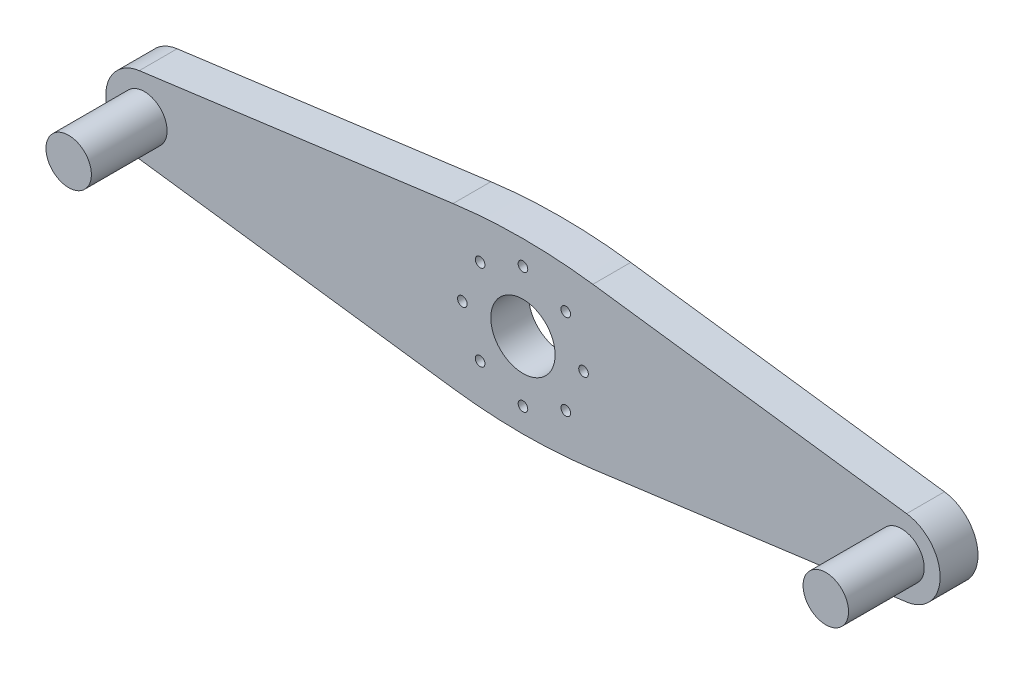
ISO-10303-21;
HEADER;
FILE_DESCRIPTION(('STEP AP214'),'2;1');
FILE_NAME('part.step','',(''),(''),'','','');
FILE_SCHEMA(('AUTOMOTIVE_DESIGN { 1 0 10303 214 1 1 1 1 }'));
ENDSEC;
DATA;
#1=APPLICATION_CONTEXT('core data for automotive mechanical design processes');
#2=APPLICATION_PROTOCOL_DEFINITION('international standard','automotive_design',2000,#1);
#3=PRODUCT_CONTEXT('',#1,'mechanical');
#4=PRODUCT('Part','Part','',(#3));
#5=PRODUCT_RELATED_PRODUCT_CATEGORY('part','',(#4));
#6=PRODUCT_DEFINITION_FORMATION('','',#4);
#7=PRODUCT_DEFINITION_CONTEXT('part definition',#1,'design');
#8=PRODUCT_DEFINITION('design','',#6,#7);
#9=PRODUCT_DEFINITION_SHAPE('','',#8);
#10=(LENGTH_UNIT() NAMED_UNIT(*) SI_UNIT(.MILLI.,.METRE.));
#11=(NAMED_UNIT(*) PLANE_ANGLE_UNIT() SI_UNIT($,.RADIAN.));
#12=(NAMED_UNIT(*) SI_UNIT($,.STERADIAN.) SOLID_ANGLE_UNIT());
#13=UNCERTAINTY_MEASURE_WITH_UNIT(LENGTH_MEASURE(1.E-05),#10,'distance_accuracy_value','');
#14=(GEOMETRIC_REPRESENTATION_CONTEXT(3) GLOBAL_UNCERTAINTY_ASSIGNED_CONTEXT((#13)) GLOBAL_UNIT_ASSIGNED_CONTEXT((#10,
#11,#12)) REPRESENTATION_CONTEXT('',''));
#15=CARTESIAN_POINT('',(0.,0.,0.));
#16=DIRECTION('',(0.,0.,1.));
#17=DIRECTION('',(1.,0.,0.));
#18=AXIS2_PLACEMENT_3D('',#15,#16,#17);
#19=CARTESIAN_POINT('',(50.,0.,5.));
#20=DIRECTION('',(0.,0.,-1.));
#21=DIRECTION('',(-1.,0.,0.));
#22=AXIS2_PLACEMENT_3D('',#19,#20,#21);
#23=PLANE('',#22);
#24=CARTESIAN_POINT('',(50.,0.,5.));
#25=DIRECTION('',(0.,0.,1.));
#26=DIRECTION('',(-1.,0.,0.));
#27=AXIS2_PLACEMENT_3D('',#24,#25,#26);
#28=CIRCLE('',#27,5.10024633771241);
#29=CARTESIAN_POINT('',(50.6728763500851,-5.05566515137672,5.));
#30=VERTEX_POINT('',#29);
#31=CARTESIAN_POINT('',(50.6728763500851,5.05566515137672,5.));
#32=VERTEX_POINT('',#31);
#33=EDGE_CURVE('E148',#30,#32,#28,.T.);
#34=ORIENTED_EDGE('',*,*,#33,.T.);
#35=DIRECTION('',(-0.991259013117456,0.131930166805804,0.));
#36=VECTOR('',#35,1.);
#37=CARTESIAN_POINT('',(50.6728763500851,5.05566515137672,5.));
#38=LINE('',#37,#36);
#39=CARTESIAN_POINT('',(9.2351116764065,10.5707637614413,5.));
#40=VERTEX_POINT('',#39);
#41=EDGE_CURVE('E96',#32,#40,#38,.T.);
#42=ORIENTED_EDGE('',*,*,#41,.T.);
#43=CARTESIAN_POINT('',(0.,-58.8173671567806,5.));
#44=DIRECTION('',(0.,0.,1.));
#45=DIRECTION('',(-1.,0.,0.));
#46=AXIS2_PLACEMENT_3D('',#43,#44,#45);
#47=CIRCLE('',#46,70.);
#48=CARTESIAN_POINT('',(-9.23511167640649,10.5707637614413,5.));
#49=VERTEX_POINT('',#48);
#50=EDGE_CURVE('E163',#40,#49,#47,.T.);
#51=ORIENTED_EDGE('',*,*,#50,.T.);
#52=DIRECTION('',(-0.991259013117456,-0.131930166805804,0.));
#53=VECTOR('',#52,1.);
#54=CARTESIAN_POINT('',(-50.6728763500851,5.05566515137672,5.));
#55=LINE('',#54,#53);
#56=CARTESIAN_POINT('',(-50.6728763500851,5.05566515137672,5.));
#57=VERTEX_POINT('',#56);
#58=EDGE_CURVE('E176',#49,#57,#55,.T.);
#59=ORIENTED_EDGE('',*,*,#58,.T.);
#60=CARTESIAN_POINT('',(-50.,0.,5.));
#61=DIRECTION('',(0.,0.,1.));
#62=DIRECTION('',(1.,0.,0.));
#63=AXIS2_PLACEMENT_3D('',#60,#61,#62);
#64=CIRCLE('',#63,5.10024633771241);
#65=CARTESIAN_POINT('',(-50.6728763500851,-5.05566515137672,5.));
#66=VERTEX_POINT('',#65);
#67=EDGE_CURVE('E115',#57,#66,#64,.T.);
#68=ORIENTED_EDGE('',*,*,#67,.T.);
#69=DIRECTION('',(0.991259013117456,-0.131930166805804,0.));
#70=VECTOR('',#69,1.);
#71=CARTESIAN_POINT('',(-50.6728763500851,-5.05566515137672,5.));
#72=LINE('',#71,#70);
#73=CARTESIAN_POINT('',(-9.23511167640653,-10.5707637614413,5.));
#74=VERTEX_POINT('',#73);
#75=EDGE_CURVE('E109',#66,#74,#72,.T.);
#76=ORIENTED_EDGE('',*,*,#75,.T.);
#77=CARTESIAN_POINT('',(0.,58.8173671567806,5.));
#78=DIRECTION('',(0.,0.,1.));
#79=DIRECTION('',(1.,0.,0.));
#80=AXIS2_PLACEMENT_3D('',#77,#78,#79);
#81=CIRCLE('',#80,70.);
#82=CARTESIAN_POINT('',(9.23511167640649,-10.5707637614413,5.));
#83=VERTEX_POINT('',#82);
#84=EDGE_CURVE('E113',#74,#83,#81,.T.);
#85=ORIENTED_EDGE('',*,*,#84,.T.);
#86=DIRECTION('',(0.991259013117456,0.131930166805804,0.));
#87=VECTOR('',#86,1.);
#88=CARTESIAN_POINT('',(50.6728763500851,-5.05566515137672,5.));
#89=LINE('',#88,#87);
#90=EDGE_CURVE('E53',#83,#30,#89,.T.);
#91=ORIENTED_EDGE('',*,*,#90,.T.);
#92=EDGE_LOOP('',(#34,#42,#51,#59,#68,#76,#85,#91));
#93=FACE_BOUND('',#92,.T.);
#94=CARTESIAN_POINT('',(0.,0.,5.));
#95=DIRECTION('',(0.,0.,1.));
#96=DIRECTION('',(1.,0.,0.));
#97=AXIS2_PLACEMENT_3D('',#94,#95,#96);
#98=CIRCLE('',#97,4.25);
#99=CARTESIAN_POINT('',(4.25,0.,5.));
#100=VERTEX_POINT('',#99);
#101=EDGE_CURVE('E137',#100,#100,#98,.T.);
#102=ORIENTED_EDGE('',*,*,#101,.F.);
#103=EDGE_LOOP('',(#102));
#104=FACE_BOUND('',#103,.T.);
#105=CARTESIAN_POINT('',(-8.,0.,5.));
#106=DIRECTION('',(0.,0.,1.));
#107=DIRECTION('',(1.,0.,0.));
#108=AXIS2_PLACEMENT_3D('',#105,#106,#107);
#109=CIRCLE('',#108,0.635000000000001);
#110=CARTESIAN_POINT('',(-7.365,0.,5.));
#111=VERTEX_POINT('',#110);
#112=EDGE_CURVE('E185',#111,#111,#109,.T.);
#113=ORIENTED_EDGE('',*,*,#112,.F.);
#114=EDGE_LOOP('',(#113));
#115=FACE_BOUND('',#114,.T.);
#116=CARTESIAN_POINT('',(-50.,0.,5.));
#117=DIRECTION('',(0.,0.,1.));
#118=DIRECTION('',(1.,0.,0.));
#119=AXIS2_PLACEMENT_3D('',#116,#117,#118);
#120=CIRCLE('',#119,3.);
#121=CARTESIAN_POINT('',(-47.,0.,5.));
#122=VERTEX_POINT('',#121);
#123=EDGE_CURVE('E191',#122,#122,#120,.T.);
#124=ORIENTED_EDGE('',*,*,#123,.F.);
#125=EDGE_LOOP('',(#124));
#126=FACE_BOUND('',#125,.T.);
#127=CARTESIAN_POINT('',(-5.65685424949237,5.65685424949239,5.));
#128=DIRECTION('',(0.,0.,1.));
#129=DIRECTION('',(1.,0.,0.));
#130=AXIS2_PLACEMENT_3D('',#127,#128,#129);
#131=CIRCLE('',#130,0.635000000000001);
#132=CARTESIAN_POINT('',(-5.02185424949237,5.65685424949239,5.));
#133=VERTEX_POINT('',#132);
#134=EDGE_CURVE('E196',#133,#133,#131,.T.);
#135=ORIENTED_EDGE('',*,*,#134,.F.);
#136=EDGE_LOOP('',(#135));
#137=FACE_BOUND('',#136,.T.);
#138=CARTESIAN_POINT('',(0.,8.,5.));
#139=DIRECTION('',(0.,0.,1.));
#140=DIRECTION('',(1.,0.,0.));
#141=AXIS2_PLACEMENT_3D('',#138,#139,#140);
#142=CIRCLE('',#141,0.635000000000001);
#143=CARTESIAN_POINT('',(0.63500000000003,8.,5.));
#144=VERTEX_POINT('',#143);
#145=EDGE_CURVE('E200',#144,#144,#142,.T.);
#146=ORIENTED_EDGE('',*,*,#145,.F.);
#147=EDGE_LOOP('',(#146));
#148=FACE_BOUND('',#147,.T.);
#149=CARTESIAN_POINT('',(50.,0.,5.));
#150=DIRECTION('',(0.,0.,1.));
#151=DIRECTION('',(-1.,0.,0.));
#152=AXIS2_PLACEMENT_3D('',#149,#150,#151);
#153=CIRCLE('',#152,3.);
#154=CARTESIAN_POINT('',(47.,0.,5.));
#155=VERTEX_POINT('',#154);
#156=EDGE_CURVE('E206',#155,#155,#153,.T.);
#157=ORIENTED_EDGE('',*,*,#156,.F.);
#158=EDGE_LOOP('',(#157));
#159=FACE_BOUND('',#158,.T.);
#160=CARTESIAN_POINT('',(5.65685424949241,5.65685424949235,5.));
#161=DIRECTION('',(0.,0.,1.));
#162=DIRECTION('',(1.,0.,0.));
#163=AXIS2_PLACEMENT_3D('',#160,#161,#162);
#164=CIRCLE('',#163,0.635);
#165=CARTESIAN_POINT('',(6.29185424949241,5.65685424949235,5.));
#166=VERTEX_POINT('',#165);
#167=EDGE_CURVE('E211',#166,#166,#164,.T.);
#168=ORIENTED_EDGE('',*,*,#167,.F.);
#169=EDGE_LOOP('',(#168));
#170=FACE_BOUND('',#169,.T.);
#171=CARTESIAN_POINT('',(8.,0.,5.));
#172=DIRECTION('',(0.,0.,1.));
#173=DIRECTION('',(1.,0.,0.));
#174=AXIS2_PLACEMENT_3D('',#171,#172,#173);
#175=CIRCLE('',#174,0.635);
#176=CARTESIAN_POINT('',(8.635,0.,5.));
#177=VERTEX_POINT('',#176);
#178=EDGE_CURVE('E215',#177,#177,#175,.T.);
#179=ORIENTED_EDGE('',*,*,#178,.F.);
#180=EDGE_LOOP('',(#179));
#181=FACE_BOUND('',#180,.T.);
#182=CARTESIAN_POINT('',(5.65685424949233,-5.65685424949243,5.));
#183=DIRECTION('',(0.,0.,1.));
#184=DIRECTION('',(1.,0.,0.));
#185=AXIS2_PLACEMENT_3D('',#182,#183,#184);
#186=CIRCLE('',#185,0.635000000000001);
#187=CARTESIAN_POINT('',(6.29185424949233,-5.65685424949243,5.));
#188=VERTEX_POINT('',#187);
#189=EDGE_CURVE('E221',#188,#188,#186,.T.);
#190=ORIENTED_EDGE('',*,*,#189,.F.);
#191=EDGE_LOOP('',(#190));
#192=FACE_BOUND('',#191,.T.);
#193=CARTESIAN_POINT('',(0.,-8.,5.));
#194=DIRECTION('',(0.,0.,1.));
#195=DIRECTION('',(1.,0.,0.));
#196=AXIS2_PLACEMENT_3D('',#193,#194,#195);
#197=CIRCLE('',#196,0.635);
#198=CARTESIAN_POINT('',(0.634999999999915,-8.,5.));
#199=VERTEX_POINT('',#198);
#200=EDGE_CURVE('E227',#199,#199,#197,.T.);
#201=ORIENTED_EDGE('',*,*,#200,.F.);
#202=EDGE_LOOP('',(#201));
#203=FACE_BOUND('',#202,.T.);
#204=CARTESIAN_POINT('',(-5.65685424949245,-5.65685424949231,5.));
#205=DIRECTION('',(0.,0.,1.));
#206=DIRECTION('',(1.,0.,0.));
#207=AXIS2_PLACEMENT_3D('',#204,#205,#206);
#208=CIRCLE('',#207,0.635);
#209=CARTESIAN_POINT('',(-5.02185424949245,-5.65685424949231,5.));
#210=VERTEX_POINT('',#209);
#211=EDGE_CURVE('E233',#210,#210,#208,.T.);
#212=ORIENTED_EDGE('',*,*,#211,.F.);
#213=EDGE_LOOP('',(#212));
#214=FACE_BOUND('',#213,.T.);
#215=ADVANCED_FACE('F36',(#93,#104,#115,#126,#137,#148,#159,#170,#181,#192,#203,#214),#23,.F.);
#216=CARTESIAN_POINT('',(50.,0.,0.));
#217=DIRECTION('',(0.,0.,-1.));
#218=DIRECTION('',(-1.,0.,0.));
#219=AXIS2_PLACEMENT_3D('',#216,#217,#218);
#220=PLANE('',#219);
#221=CARTESIAN_POINT('',(0.,-8.,0.));
#222=DIRECTION('',(0.,0.,1.));
#223=DIRECTION('',(1.,0.,0.));
#224=AXIS2_PLACEMENT_3D('',#221,#222,#223);
#225=CIRCLE('',#224,0.635);
#226=CARTESIAN_POINT('',(0.634999999999915,-8.,0.));
#227=VERTEX_POINT('',#226);
#228=EDGE_CURVE('E230',#227,#227,#225,.T.);
#229=ORIENTED_EDGE('',*,*,#228,.T.);
#230=EDGE_LOOP('',(#229));
#231=FACE_BOUND('',#230,.T.);
#232=CARTESIAN_POINT('',(8.,0.,0.));
#233=DIRECTION('',(0.,0.,1.));
#234=DIRECTION('',(1.,0.,0.));
#235=AXIS2_PLACEMENT_3D('',#232,#233,#234);
#236=CIRCLE('',#235,0.635);
#237=CARTESIAN_POINT('',(8.635,0.,0.));
#238=VERTEX_POINT('',#237);
#239=EDGE_CURVE('E218',#238,#238,#236,.T.);
#240=ORIENTED_EDGE('',*,*,#239,.T.);
#241=EDGE_LOOP('',(#240));
#242=FACE_BOUND('',#241,.T.);
#243=CARTESIAN_POINT('',(-5.65685424949237,5.65685424949239,0.));
#244=DIRECTION('',(0.,0.,1.));
#245=DIRECTION('',(1.,0.,0.));
#246=AXIS2_PLACEMENT_3D('',#243,#244,#245);
#247=CIRCLE('',#246,0.635000000000001);
#248=CARTESIAN_POINT('',(-5.02185424949237,5.65685424949239,0.));
#249=VERTEX_POINT('',#248);
#250=EDGE_CURVE('E197',#249,#249,#247,.T.);
#251=ORIENTED_EDGE('',*,*,#250,.T.);
#252=EDGE_LOOP('',(#251));
#253=FACE_BOUND('',#252,.T.);
#254=CARTESIAN_POINT('',(-8.,0.,0.));
#255=DIRECTION('',(0.,0.,1.));
#256=DIRECTION('',(1.,0.,0.));
#257=AXIS2_PLACEMENT_3D('',#254,#255,#256);
#258=CIRCLE('',#257,0.635000000000001);
#259=CARTESIAN_POINT('',(-7.365,0.,0.));
#260=VERTEX_POINT('',#259);
#261=EDGE_CURVE('E188',#260,#260,#258,.T.);
#262=ORIENTED_EDGE('',*,*,#261,.T.);
#263=EDGE_LOOP('',(#262));
#264=FACE_BOUND('',#263,.T.);
#265=CARTESIAN_POINT('',(50.,0.,0.));
#266=DIRECTION('',(0.,0.,1.));
#267=DIRECTION('',(-1.,0.,0.));
#268=AXIS2_PLACEMENT_3D('',#265,#266,#267);
#269=CIRCLE('',#268,5.10024633771241);
#270=CARTESIAN_POINT('',(50.6728763500851,-5.05566515137672,0.));
#271=VERTEX_POINT('',#270);
#272=CARTESIAN_POINT('',(50.6728763500851,5.05566515137672,0.));
#273=VERTEX_POINT('',#272);
#274=EDGE_CURVE('E133',#271,#273,#269,.T.);
#275=ORIENTED_EDGE('',*,*,#274,.F.);
#276=DIRECTION('',(0.991259013117456,0.131930166805804,0.));
#277=VECTOR('',#276,1.);
#278=CARTESIAN_POINT('',(50.6728763500851,-5.05566515137672,0.));
#279=LINE('',#278,#277);
#280=CARTESIAN_POINT('',(9.23511167640649,-10.5707637614413,0.));
#281=VERTEX_POINT('',#280);
#282=EDGE_CURVE('E88',#281,#271,#279,.T.);
#283=ORIENTED_EDGE('',*,*,#282,.F.);
#284=CARTESIAN_POINT('',(0.,58.8173671567806,0.));
#285=DIRECTION('',(0.,0.,1.));
#286=DIRECTION('',(1.,0.,0.));
#287=AXIS2_PLACEMENT_3D('',#284,#285,#286);
#288=CIRCLE('',#287,70.);
#289=CARTESIAN_POINT('',(-9.23511167640653,-10.5707637614413,0.));
#290=VERTEX_POINT('',#289);
#291=EDGE_CURVE('E82',#290,#281,#288,.T.);
#292=ORIENTED_EDGE('',*,*,#291,.F.);
#293=DIRECTION('',(0.991259013117456,-0.131930166805804,0.));
#294=VECTOR('',#293,1.);
#295=CARTESIAN_POINT('',(-50.6728763500851,-5.05566515137672,0.));
#296=LINE('',#295,#294);
#297=CARTESIAN_POINT('',(-50.6728763500851,-5.05566515137672,0.));
#298=VERTEX_POINT('',#297);
#299=EDGE_CURVE('E123',#298,#290,#296,.T.);
#300=ORIENTED_EDGE('',*,*,#299,.F.);
#301=CARTESIAN_POINT('',(-50.,0.,0.));
#302=DIRECTION('',(0.,0.,1.));
#303=DIRECTION('',(1.,0.,0.));
#304=AXIS2_PLACEMENT_3D('',#301,#302,#303);
#305=CIRCLE('',#304,5.10024633771241);
#306=CARTESIAN_POINT('',(-50.6728763500851,5.05566515137672,0.));
#307=VERTEX_POINT('',#306);
#308=EDGE_CURVE('E143',#307,#298,#305,.T.);
#309=ORIENTED_EDGE('',*,*,#308,.F.);
#310=DIRECTION('',(-0.991259013117456,-0.131930166805804,0.));
#311=VECTOR('',#310,1.);
#312=CARTESIAN_POINT('',(-50.6728763500851,5.05566515137672,0.));
#313=LINE('',#312,#311);
#314=CARTESIAN_POINT('',(-9.23511167640649,10.5707637614413,0.));
#315=VERTEX_POINT('',#314);
#316=EDGE_CURVE('E141',#315,#307,#313,.T.);
#317=ORIENTED_EDGE('',*,*,#316,.F.);
#318=CARTESIAN_POINT('',(0.,-58.8173671567806,0.));
#319=DIRECTION('',(0.,0.,1.));
#320=DIRECTION('',(-1.,0.,0.));
#321=AXIS2_PLACEMENT_3D('',#318,#319,#320);
#322=CIRCLE('',#321,70.);
#323=CARTESIAN_POINT('',(9.2351116764065,10.5707637614413,0.));
#324=VERTEX_POINT('',#323);
#325=EDGE_CURVE('E139',#324,#315,#322,.T.);
#326=ORIENTED_EDGE('',*,*,#325,.F.);
#327=DIRECTION('',(-0.991259013117456,0.131930166805804,0.));
#328=VECTOR('',#327,1.);
#329=CARTESIAN_POINT('',(50.6728763500851,5.05566515137672,0.));
#330=LINE('',#329,#328);
#331=EDGE_CURVE('E136',#273,#324,#330,.T.);
#332=ORIENTED_EDGE('',*,*,#331,.F.);
#333=EDGE_LOOP('',(#275,#283,#292,#300,#309,#317,#326,#332));
#334=FACE_BOUND('',#333,.T.);
#335=CARTESIAN_POINT('',(0.,0.,0.));
#336=DIRECTION('',(0.,0.,1.));
#337=DIRECTION('',(1.,0.,0.));
#338=AXIS2_PLACEMENT_3D('',#335,#336,#337);
#339=CIRCLE('',#338,4.25);
#340=CARTESIAN_POINT('',(4.25,0.,0.));
#341=VERTEX_POINT('',#340);
#342=EDGE_CURVE('E182',#341,#341,#339,.T.);
#343=ORIENTED_EDGE('',*,*,#342,.T.);
#344=EDGE_LOOP('',(#343));
#345=FACE_BOUND('',#344,.T.);
#346=CARTESIAN_POINT('',(0.,8.,0.));
#347=DIRECTION('',(0.,0.,1.));
#348=DIRECTION('',(1.,0.,0.));
#349=AXIS2_PLACEMENT_3D('',#346,#347,#348);
#350=CIRCLE('',#349,0.635000000000001);
#351=CARTESIAN_POINT('',(0.63500000000003,8.,0.));
#352=VERTEX_POINT('',#351);
#353=EDGE_CURVE('E203',#352,#352,#350,.T.);
#354=ORIENTED_EDGE('',*,*,#353,.T.);
#355=EDGE_LOOP('',(#354));
#356=FACE_BOUND('',#355,.T.);
#357=CARTESIAN_POINT('',(5.65685424949241,5.65685424949235,0.));
#358=DIRECTION('',(0.,0.,1.));
#359=DIRECTION('',(1.,0.,0.));
#360=AXIS2_PLACEMENT_3D('',#357,#358,#359);
#361=CIRCLE('',#360,0.635);
#362=CARTESIAN_POINT('',(6.29185424949241,5.65685424949235,0.));
#363=VERTEX_POINT('',#362);
#364=EDGE_CURVE('E212',#363,#363,#361,.T.);
#365=ORIENTED_EDGE('',*,*,#364,.T.);
#366=EDGE_LOOP('',(#365));
#367=FACE_BOUND('',#366,.T.);
#368=CARTESIAN_POINT('',(5.65685424949233,-5.65685424949243,0.));
#369=DIRECTION('',(0.,0.,1.));
#370=DIRECTION('',(1.,0.,0.));
#371=AXIS2_PLACEMENT_3D('',#368,#369,#370);
#372=CIRCLE('',#371,0.635000000000001);
#373=CARTESIAN_POINT('',(6.29185424949233,-5.65685424949243,0.));
#374=VERTEX_POINT('',#373);
#375=EDGE_CURVE('E224',#374,#374,#372,.T.);
#376=ORIENTED_EDGE('',*,*,#375,.T.);
#377=EDGE_LOOP('',(#376));
#378=FACE_BOUND('',#377,.T.);
#379=CARTESIAN_POINT('',(-5.65685424949245,-5.65685424949231,0.));
#380=DIRECTION('',(0.,0.,1.));
#381=DIRECTION('',(1.,0.,0.));
#382=AXIS2_PLACEMENT_3D('',#379,#380,#381);
#383=CIRCLE('',#382,0.635);
#384=CARTESIAN_POINT('',(-5.02185424949245,-5.65685424949231,0.));
#385=VERTEX_POINT('',#384);
#386=EDGE_CURVE('E236',#385,#385,#383,.T.);
#387=ORIENTED_EDGE('',*,*,#386,.T.);
#388=EDGE_LOOP('',(#387));
#389=FACE_BOUND('',#388,.T.);
#390=ADVANCED_FACE('F167',(#231,#242,#253,#264,#334,#345,#356,#367,#378,#389),#220,.T.);
#391=CARTESIAN_POINT('',(50.,0.,5.));
#392=DIRECTION('',(0.,0.,-1.));
#393=DIRECTION('',(-1.,0.,0.));
#394=AXIS2_PLACEMENT_3D('',#391,#392,#393);
#395=CYLINDRICAL_SURFACE('',#394,5.10024633771241);
#396=ORIENTED_EDGE('',*,*,#274,.T.);
#397=DIRECTION('',(0.,0.,-1.));
#398=VECTOR('',#397,1.);
#399=CARTESIAN_POINT('',(50.6728763500851,5.05566515137672,5.));
#400=LINE('',#399,#398);
#401=EDGE_CURVE('E11',#32,#273,#400,.T.);
#402=ORIENTED_EDGE('',*,*,#401,.F.);
#403=ORIENTED_EDGE('',*,*,#33,.F.);
#404=DIRECTION('',(0.,0.,-1.));
#405=VECTOR('',#404,1.);
#406=CARTESIAN_POINT('',(50.6728763500851,-5.05566515137672,5.));
#407=LINE('',#406,#405);
#408=EDGE_CURVE('E129',#30,#271,#407,.T.);
#409=ORIENTED_EDGE('',*,*,#408,.T.);
#410=EDGE_LOOP('',(#396,#402,#403,#409));
#411=FACE_BOUND('',#410,.T.);
#412=ADVANCED_FACE('F38',(#411),#395,.T.);
#413=CARTESIAN_POINT('',(50.6728763500851,5.05566515137672,5.));
#414=DIRECTION('',(-0.131930166805804,-0.991259013117456,0.));
#415=DIRECTION('',(0.991259013117456,-0.131930166805804,0.));
#416=AXIS2_PLACEMENT_3D('',#413,#414,#415);
#417=PLANE('',#416);
#418=ORIENTED_EDGE('',*,*,#331,.T.);
#419=DIRECTION('',(0.,0.,-1.));
#420=VECTOR('',#419,1.);
#421=CARTESIAN_POINT('',(9.2351116764065,10.5707637614413,5.));
#422=LINE('',#421,#420);
#423=EDGE_CURVE('E45',#40,#324,#422,.T.);
#424=ORIENTED_EDGE('',*,*,#423,.F.);
#425=ORIENTED_EDGE('',*,*,#41,.F.);
#426=ORIENTED_EDGE('',*,*,#401,.T.);
#427=EDGE_LOOP('',(#418,#424,#425,#426));
#428=FACE_BOUND('',#427,.T.);
#429=ADVANCED_FACE('F282',(#428),#417,.F.);
#430=CARTESIAN_POINT('',(0.,-58.8173671567806,5.));
#431=DIRECTION('',(0.,0.,-1.));
#432=DIRECTION('',(-1.,0.,0.));
#433=AXIS2_PLACEMENT_3D('',#430,#431,#432);
#434=CYLINDRICAL_SURFACE('',#433,70.);
#435=ORIENTED_EDGE('',*,*,#325,.T.);
#436=DIRECTION('',(0.,0.,-1.));
#437=VECTOR('',#436,1.);
#438=CARTESIAN_POINT('',(-9.23511167640649,10.5707637614413,5.));
#439=LINE('',#438,#437);
#440=EDGE_CURVE('E155',#49,#315,#439,.T.);
#441=ORIENTED_EDGE('',*,*,#440,.F.);
#442=ORIENTED_EDGE('',*,*,#50,.F.);
#443=ORIENTED_EDGE('',*,*,#423,.T.);
#444=EDGE_LOOP('',(#435,#441,#442,#443));
#445=FACE_BOUND('',#444,.T.);
#446=ADVANCED_FACE('F161',(#445),#434,.T.);
#447=CARTESIAN_POINT('',(-50.6728763500851,5.05566515137672,5.));
#448=DIRECTION('',(0.131930166805804,-0.991259013117456,0.));
#449=DIRECTION('',(0.991259013117456,0.131930166805804,0.));
#450=AXIS2_PLACEMENT_3D('',#447,#448,#449);
#451=PLANE('',#450);
#452=ORIENTED_EDGE('',*,*,#316,.T.);
#453=DIRECTION('',(0.,0.,-1.));
#454=VECTOR('',#453,1.);
#455=CARTESIAN_POINT('',(-50.6728763500851,5.05566515137672,5.));
#456=LINE('',#455,#454);
#457=EDGE_CURVE('E152',#57,#307,#456,.T.);
#458=ORIENTED_EDGE('',*,*,#457,.F.);
#459=ORIENTED_EDGE('',*,*,#58,.F.);
#460=ORIENTED_EDGE('',*,*,#440,.T.);
#461=EDGE_LOOP('',(#452,#458,#459,#460));
#462=FACE_BOUND('',#461,.T.);
#463=ADVANCED_FACE('F172',(#462),#451,.F.);
#464=CARTESIAN_POINT('',(-50.,0.,5.));
#465=DIRECTION('',(0.,0.,-1.));
#466=DIRECTION('',(-1.,0.,0.));
#467=AXIS2_PLACEMENT_3D('',#464,#465,#466);
#468=CYLINDRICAL_SURFACE('',#467,5.10024633771241);
#469=ORIENTED_EDGE('',*,*,#308,.T.);
#470=DIRECTION('',(0.,0.,-1.));
#471=VECTOR('',#470,1.);
#472=CARTESIAN_POINT('',(-50.6728763500851,-5.05566515137672,5.));
#473=LINE('',#472,#471);
#474=EDGE_CURVE('E124',#66,#298,#473,.T.);
#475=ORIENTED_EDGE('',*,*,#474,.F.);
#476=ORIENTED_EDGE('',*,*,#67,.F.);
#477=ORIENTED_EDGE('',*,*,#457,.T.);
#478=EDGE_LOOP('',(#469,#475,#476,#477));
#479=FACE_BOUND('',#478,.T.);
#480=ADVANCED_FACE('F175',(#479),#468,.T.);
#481=CARTESIAN_POINT('',(-50.6728763500851,-5.05566515137672,5.));
#482=DIRECTION('',(0.131930166805804,0.991259013117456,0.));
#483=DIRECTION('',(-0.991259013117456,0.131930166805804,0.));
#484=AXIS2_PLACEMENT_3D('',#481,#482,#483);
#485=PLANE('',#484);
#486=ORIENTED_EDGE('',*,*,#299,.T.);
#487=DIRECTION('',(0.,0.,-1.));
#488=VECTOR('',#487,1.);
#489=CARTESIAN_POINT('',(-9.23511167640653,-10.5707637614413,5.));
#490=LINE('',#489,#488);
#491=EDGE_CURVE('E120',#74,#290,#490,.T.);
#492=ORIENTED_EDGE('',*,*,#491,.F.);
#493=ORIENTED_EDGE('',*,*,#75,.F.);
#494=ORIENTED_EDGE('',*,*,#474,.T.);
#495=EDGE_LOOP('',(#486,#492,#493,#494));
#496=FACE_BOUND('',#495,.T.);
#497=ADVANCED_FACE('F121',(#496),#485,.F.);
#498=CARTESIAN_POINT('',(0.,58.8173671567806,5.));
#499=DIRECTION('',(0.,0.,-1.));
#500=DIRECTION('',(-1.,0.,0.));
#501=AXIS2_PLACEMENT_3D('',#498,#499,#500);
#502=CYLINDRICAL_SURFACE('',#501,70.);
#503=ORIENTED_EDGE('',*,*,#291,.T.);
#504=DIRECTION('',(0.,0.,-1.));
#505=VECTOR('',#504,1.);
#506=CARTESIAN_POINT('',(9.23511167640649,-10.5707637614413,5.));
#507=LINE('',#506,#505);
#508=EDGE_CURVE('E125',#83,#281,#507,.T.);
#509=ORIENTED_EDGE('',*,*,#508,.F.);
#510=ORIENTED_EDGE('',*,*,#84,.F.);
#511=ORIENTED_EDGE('',*,*,#491,.T.);
#512=EDGE_LOOP('',(#503,#509,#510,#511));
#513=FACE_BOUND('',#512,.T.);
#514=ADVANCED_FACE('F127',(#513),#502,.T.);
#515=CARTESIAN_POINT('',(50.6728763500851,-5.05566515137672,5.));
#516=DIRECTION('',(-0.131930166805804,0.991259013117456,0.));
#517=DIRECTION('',(-0.991259013117456,-0.131930166805804,0.));
#518=AXIS2_PLACEMENT_3D('',#515,#516,#517);
#519=PLANE('',#518);
#520=ORIENTED_EDGE('',*,*,#282,.T.);
#521=ORIENTED_EDGE('',*,*,#408,.F.);
#522=ORIENTED_EDGE('',*,*,#90,.F.);
#523=ORIENTED_EDGE('',*,*,#508,.T.);
#524=EDGE_LOOP('',(#520,#521,#522,#523));
#525=FACE_BOUND('',#524,.T.);
#526=ADVANCED_FACE('F270',(#525),#519,.F.);
#527=CARTESIAN_POINT('',(0.,0.,5.));
#528=DIRECTION('',(0.,0.,-1.));
#529=DIRECTION('',(-1.,0.,0.));
#530=AXIS2_PLACEMENT_3D('',#527,#528,#529);
#531=CYLINDRICAL_SURFACE('',#530,4.25);
#532=ORIENTED_EDGE('',*,*,#101,.T.);
#533=EDGE_LOOP('',(#532));
#534=FACE_BOUND('',#533,.T.);
#535=ORIENTED_EDGE('',*,*,#342,.F.);
#536=EDGE_LOOP('',(#535));
#537=FACE_BOUND('',#536,.T.);
#538=ADVANCED_FACE('F267',(#534,#537),#531,.F.);
#539=CARTESIAN_POINT('',(-8.,0.,5.));
#540=DIRECTION('',(0.,0.,-1.));
#541=DIRECTION('',(-1.,0.,0.));
#542=AXIS2_PLACEMENT_3D('',#539,#540,#541);
#543=CYLINDRICAL_SURFACE('',#542,0.635000000000001);
#544=ORIENTED_EDGE('',*,*,#112,.T.);
#545=EDGE_LOOP('',(#544));
#546=FACE_BOUND('',#545,.T.);
#547=ORIENTED_EDGE('',*,*,#261,.F.);
#548=EDGE_LOOP('',(#547));
#549=FACE_BOUND('',#548,.T.);
#550=ADVANCED_FACE('F361',(#546,#549),#543,.F.);
#551=CARTESIAN_POINT('',(-5.65685424949237,5.65685424949239,5.));
#552=DIRECTION('',(0.,0.,-1.));
#553=DIRECTION('',(-1.,0.,0.));
#554=AXIS2_PLACEMENT_3D('',#551,#552,#553);
#555=CYLINDRICAL_SURFACE('',#554,0.635000000000001);
#556=ORIENTED_EDGE('',*,*,#134,.T.);
#557=EDGE_LOOP('',(#556));
#558=FACE_BOUND('',#557,.T.);
#559=ORIENTED_EDGE('',*,*,#250,.F.);
#560=EDGE_LOOP('',(#559));
#561=FACE_BOUND('',#560,.T.);
#562=ADVANCED_FACE('F358',(#558,#561),#555,.F.);
#563=CARTESIAN_POINT('',(0.,8.,5.));
#564=DIRECTION('',(0.,0.,-1.));
#565=DIRECTION('',(-1.,0.,0.));
#566=AXIS2_PLACEMENT_3D('',#563,#564,#565);
#567=CYLINDRICAL_SURFACE('',#566,0.635000000000001);
#568=ORIENTED_EDGE('',*,*,#145,.T.);
#569=EDGE_LOOP('',(#568));
#570=FACE_BOUND('',#569,.T.);
#571=ORIENTED_EDGE('',*,*,#353,.F.);
#572=EDGE_LOOP('',(#571));
#573=FACE_BOUND('',#572,.T.);
#574=ADVANCED_FACE('F354',(#570,#573),#567,.F.);
#575=CARTESIAN_POINT('',(5.65685424949241,5.65685424949235,5.));
#576=DIRECTION('',(0.,0.,-1.));
#577=DIRECTION('',(-1.,0.,0.));
#578=AXIS2_PLACEMENT_3D('',#575,#576,#577);
#579=CYLINDRICAL_SURFACE('',#578,0.635);
#580=ORIENTED_EDGE('',*,*,#167,.T.);
#581=EDGE_LOOP('',(#580));
#582=FACE_BOUND('',#581,.T.);
#583=ORIENTED_EDGE('',*,*,#364,.F.);
#584=EDGE_LOOP('',(#583));
#585=FACE_BOUND('',#584,.T.);
#586=ADVANCED_FACE('F350',(#582,#585),#579,.F.);
#587=CARTESIAN_POINT('',(8.,0.,5.));
#588=DIRECTION('',(0.,0.,-1.));
#589=DIRECTION('',(-1.,0.,0.));
#590=AXIS2_PLACEMENT_3D('',#587,#588,#589);
#591=CYLINDRICAL_SURFACE('',#590,0.635);
#592=ORIENTED_EDGE('',*,*,#178,.T.);
#593=EDGE_LOOP('',(#592));
#594=FACE_BOUND('',#593,.T.);
#595=ORIENTED_EDGE('',*,*,#239,.F.);
#596=EDGE_LOOP('',(#595));
#597=FACE_BOUND('',#596,.T.);
#598=ADVANCED_FACE('F346',(#594,#597),#591,.F.);
#599=CARTESIAN_POINT('',(5.65685424949233,-5.65685424949243,5.));
#600=DIRECTION('',(0.,0.,-1.));
#601=DIRECTION('',(-1.,0.,0.));
#602=AXIS2_PLACEMENT_3D('',#599,#600,#601);
#603=CYLINDRICAL_SURFACE('',#602,0.635000000000001);
#604=ORIENTED_EDGE('',*,*,#189,.T.);
#605=EDGE_LOOP('',(#604));
#606=FACE_BOUND('',#605,.T.);
#607=ORIENTED_EDGE('',*,*,#375,.F.);
#608=EDGE_LOOP('',(#607));
#609=FACE_BOUND('',#608,.T.);
#610=ADVANCED_FACE('F342',(#606,#609),#603,.F.);
#611=CARTESIAN_POINT('',(0.,-8.,5.));
#612=DIRECTION('',(0.,0.,-1.));
#613=DIRECTION('',(-1.,0.,0.));
#614=AXIS2_PLACEMENT_3D('',#611,#612,#613);
#615=CYLINDRICAL_SURFACE('',#614,0.635);
#616=ORIENTED_EDGE('',*,*,#200,.T.);
#617=EDGE_LOOP('',(#616));
#618=FACE_BOUND('',#617,.T.);
#619=ORIENTED_EDGE('',*,*,#228,.F.);
#620=EDGE_LOOP('',(#619));
#621=FACE_BOUND('',#620,.T.);
#622=ADVANCED_FACE('F338',(#618,#621),#615,.F.);
#623=CARTESIAN_POINT('',(-5.65685424949245,-5.65685424949231,5.));
#624=DIRECTION('',(0.,0.,-1.));
#625=DIRECTION('',(-1.,0.,0.));
#626=AXIS2_PLACEMENT_3D('',#623,#624,#625);
#627=CYLINDRICAL_SURFACE('',#626,0.635);
#628=ORIENTED_EDGE('',*,*,#211,.T.);
#629=EDGE_LOOP('',(#628));
#630=FACE_BOUND('',#629,.T.);
#631=ORIENTED_EDGE('',*,*,#386,.F.);
#632=EDGE_LOOP('',(#631));
#633=FACE_BOUND('',#632,.T.);
#634=ADVANCED_FACE('F304',(#630,#633),#627,.F.);
#635=CARTESIAN_POINT('',(-50.,0.,15.));
#636=DIRECTION('',(0.,0.,-1.));
#637=DIRECTION('',(-1.,0.,0.));
#638=AXIS2_PLACEMENT_3D('',#635,#636,#637);
#639=CYLINDRICAL_SURFACE('',#638,3.);
#640=CARTESIAN_POINT('',(-50.,0.,15.));
#641=DIRECTION('',(0.,0.,1.));
#642=DIRECTION('',(1.,0.,0.));
#643=AXIS2_PLACEMENT_3D('',#640,#641,#642);
#644=CIRCLE('',#643,3.);
#645=CARTESIAN_POINT('',(-47.,0.,15.));
#646=VERTEX_POINT('',#645);
#647=EDGE_CURVE('E239',#646,#646,#644,.T.);
#648=ORIENTED_EDGE('',*,*,#647,.F.);
#649=EDGE_LOOP('',(#648));
#650=FACE_BOUND('',#649,.T.);
#651=ORIENTED_EDGE('',*,*,#123,.T.);
#652=EDGE_LOOP('',(#651));
#653=FACE_BOUND('',#652,.T.);
#654=ADVANCED_FACE('F309',(#650,#653),#639,.T.);
#655=CARTESIAN_POINT('',(0.,0.,15.));
#656=DIRECTION('',(0.,0.,1.));
#657=DIRECTION('',(1.,0.,0.));
#658=AXIS2_PLACEMENT_3D('',#655,#656,#657);
#659=PLANE('',#658);
#660=ORIENTED_EDGE('',*,*,#647,.T.);
#661=EDGE_LOOP('',(#660));
#662=FACE_BOUND('',#661,.T.);
#663=ADVANCED_FACE('F257',(#662),#659,.T.);
#664=CARTESIAN_POINT('',(50.,0.,15.));
#665=DIRECTION('',(0.,0.,-1.));
#666=DIRECTION('',(-1.,0.,0.));
#667=AXIS2_PLACEMENT_3D('',#664,#665,#666);
#668=CYLINDRICAL_SURFACE('',#667,3.);
#669=CARTESIAN_POINT('',(50.,0.,15.));
#670=DIRECTION('',(0.,0.,1.));
#671=DIRECTION('',(1.,0.,0.));
#672=AXIS2_PLACEMENT_3D('',#669,#670,#671);
#673=CIRCLE('',#672,3.);
#674=CARTESIAN_POINT('',(53.,0.,15.));
#675=VERTEX_POINT('',#674);
#676=EDGE_CURVE('E244',#675,#675,#673,.F.);
#677=ORIENTED_EDGE('',*,*,#676,.T.);
#678=EDGE_LOOP('',(#677));
#679=FACE_BOUND('',#678,.T.);
#680=ORIENTED_EDGE('',*,*,#156,.T.);
#681=EDGE_LOOP('',(#680));
#682=FACE_BOUND('',#681,.T.);
#683=ADVANCED_FACE('F248',(#679,#682),#668,.T.);
#684=CARTESIAN_POINT('',(0.,0.,15.));
#685=DIRECTION('',(0.,0.,1.));
#686=DIRECTION('',(1.,0.,0.));
#687=AXIS2_PLACEMENT_3D('',#684,#685,#686);
#688=PLANE('',#687);
#689=ORIENTED_EDGE('',*,*,#676,.F.);
#690=EDGE_LOOP('',(#689));
#691=FACE_BOUND('',#690,.T.);
#692=ADVANCED_FACE('F251',(#691),#688,.T.);
#693=CLOSED_SHELL('',(#215,#390,#412,#429,#446,#463,#480,#497,#514,#526,#538,#550,#562,#574,
#586,#598,#610,#622,#634,#654,#663,#683,#692));
#694=MANIFOLD_SOLID_BREP('B2',#693);
#695=ADVANCED_BREP_SHAPE_REPRESENTATION('',(#18,#694),#14);
#696=SHAPE_DEFINITION_REPRESENTATION(#9,#695);
ENDSEC;
END-ISO-10303-21;
